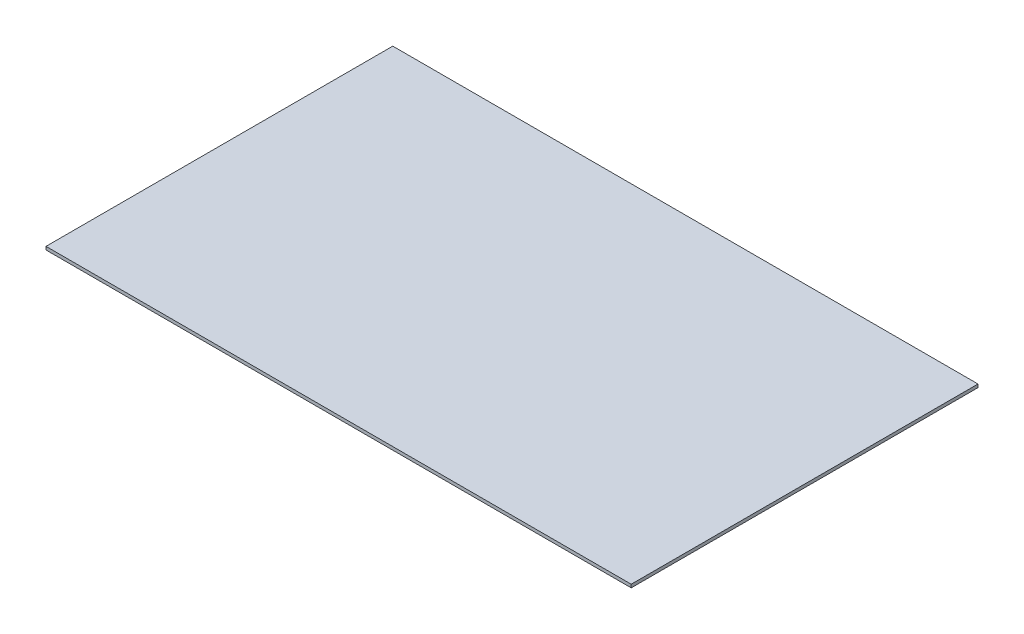
ISO-10303-21;
HEADER;
FILE_DESCRIPTION(('STEP AP214'),'2;1');
FILE_NAME('part.step','',(''),(''),'','','');
FILE_SCHEMA(('AUTOMOTIVE_DESIGN { 1 0 10303 214 1 1 1 1 }'));
ENDSEC;
DATA;
#1=APPLICATION_CONTEXT('core data for automotive mechanical design processes');
#2=APPLICATION_PROTOCOL_DEFINITION('international standard','automotive_design',2000,#1);
#3=PRODUCT_CONTEXT('',#1,'mechanical');
#4=PRODUCT('Part','Part','',(#3));
#5=PRODUCT_RELATED_PRODUCT_CATEGORY('part','',(#4));
#6=PRODUCT_DEFINITION_FORMATION('','',#4);
#7=PRODUCT_DEFINITION_CONTEXT('part definition',#1,'design');
#8=PRODUCT_DEFINITION('design','',#6,#7);
#9=PRODUCT_DEFINITION_SHAPE('','',#8);
#10=(LENGTH_UNIT() NAMED_UNIT(*) SI_UNIT(.MILLI.,.METRE.));
#11=(NAMED_UNIT(*) PLANE_ANGLE_UNIT() SI_UNIT($,.RADIAN.));
#12=(NAMED_UNIT(*) SI_UNIT($,.STERADIAN.) SOLID_ANGLE_UNIT());
#13=UNCERTAINTY_MEASURE_WITH_UNIT(LENGTH_MEASURE(1.E-05),#10,'distance_accuracy_value','');
#14=(GEOMETRIC_REPRESENTATION_CONTEXT(3) GLOBAL_UNCERTAINTY_ASSIGNED_CONTEXT((#13)) GLOBAL_UNIT_ASSIGNED_CONTEXT((#10,
#11,#12)) REPRESENTATION_CONTEXT('',''));
#15=CARTESIAN_POINT('',(0.,0.,0.));
#16=DIRECTION('',(0.,0.,1.));
#17=DIRECTION('',(1.,0.,0.));
#18=AXIS2_PLACEMENT_3D('',#15,#16,#17);
#19=CARTESIAN_POINT('',(0.,2.794,0.));
#20=DIRECTION('',(1.,0.,0.));
#21=DIRECTION('',(0.,0.,-1.));
#22=AXIS2_PLACEMENT_3D('',#19,#20,#21);
#23=PLANE('',#22);
#24=DIRECTION('',(0.,0.,1.));
#25=VECTOR('',#24,1.);
#26=CARTESIAN_POINT('',(0.,0.,0.));
#27=LINE('',#26,#25);
#28=CARTESIAN_POINT('',(0.,0.,-304.8));
#29=VERTEX_POINT('',#28);
#30=CARTESIAN_POINT('',(0.,0.,0.));
#31=VERTEX_POINT('',#30);
#32=EDGE_CURVE('E99',#29,#31,#27,.T.);
#33=ORIENTED_EDGE('',*,*,#32,.T.);
#34=DIRECTION('',(0.,-1.,0.));
#35=VECTOR('',#34,1.);
#36=CARTESIAN_POINT('',(0.,2.794,0.));
#37=LINE('',#36,#35);
#38=CARTESIAN_POINT('',(0.,2.794,0.));
#39=VERTEX_POINT('',#38);
#40=EDGE_CURVE('E11',#39,#31,#37,.T.);
#41=ORIENTED_EDGE('',*,*,#40,.F.);
#42=DIRECTION('',(0.,0.,1.));
#43=VECTOR('',#42,1.);
#44=CARTESIAN_POINT('',(0.,2.794,0.));
#45=LINE('',#44,#43);
#46=CARTESIAN_POINT('',(0.,2.794,-304.8));
#47=VERTEX_POINT('',#46);
#48=EDGE_CURVE('E87',#47,#39,#45,.T.);
#49=ORIENTED_EDGE('',*,*,#48,.F.);
#50=DIRECTION('',(0.,-1.,0.));
#51=VECTOR('',#50,1.);
#52=CARTESIAN_POINT('',(0.,2.794,-304.8));
#53=LINE('',#52,#51);
#54=EDGE_CURVE('E95',#47,#29,#53,.T.);
#55=ORIENTED_EDGE('',*,*,#54,.T.);
#56=EDGE_LOOP('',(#33,#41,#49,#55));
#57=FACE_BOUND('',#56,.T.);
#58=ADVANCED_FACE('F36',(#57),#23,.F.);
#59=CARTESIAN_POINT('',(0.,2.794,0.));
#60=DIRECTION('',(0.,0.,-1.));
#61=DIRECTION('',(-1.,0.,0.));
#62=AXIS2_PLACEMENT_3D('',#59,#60,#61);
#63=PLANE('',#62);
#64=DIRECTION('',(1.,0.,0.));
#65=VECTOR('',#64,1.);
#66=CARTESIAN_POINT('',(0.,0.,0.));
#67=LINE('',#66,#65);
#68=CARTESIAN_POINT('',(514.35,0.,0.));
#69=VERTEX_POINT('',#68);
#70=EDGE_CURVE('E91',#31,#69,#67,.T.);
#71=ORIENTED_EDGE('',*,*,#70,.T.);
#72=DIRECTION('',(0.,-1.,0.));
#73=VECTOR('',#72,1.);
#74=CARTESIAN_POINT('',(514.35,2.794,0.));
#75=LINE('',#74,#73);
#76=CARTESIAN_POINT('',(514.35,2.794,0.));
#77=VERTEX_POINT('',#76);
#78=EDGE_CURVE('E44',#77,#69,#75,.T.);
#79=ORIENTED_EDGE('',*,*,#78,.F.);
#80=DIRECTION('',(1.,0.,0.));
#81=VECTOR('',#80,1.);
#82=CARTESIAN_POINT('',(0.,2.794,0.));
#83=LINE('',#82,#81);
#84=EDGE_CURVE('E82',#39,#77,#83,.T.);
#85=ORIENTED_EDGE('',*,*,#84,.F.);
#86=ORIENTED_EDGE('',*,*,#40,.T.);
#87=EDGE_LOOP('',(#71,#79,#85,#86));
#88=FACE_BOUND('',#87,.T.);
#89=ADVANCED_FACE('F90',(#88),#63,.F.);
#90=CARTESIAN_POINT('',(514.35,2.794,0.));
#91=DIRECTION('',(-1.,0.,0.));
#92=DIRECTION('',(0.,0.,1.));
#93=AXIS2_PLACEMENT_3D('',#90,#91,#92);
#94=PLANE('',#93);
#95=DIRECTION('',(0.,0.,-1.));
#96=VECTOR('',#95,1.);
#97=CARTESIAN_POINT('',(514.35,0.,0.));
#98=LINE('',#97,#96);
#99=CARTESIAN_POINT('',(514.35,0.,-304.8));
#100=VERTEX_POINT('',#99);
#101=EDGE_CURVE('E69',#69,#100,#98,.T.);
#102=ORIENTED_EDGE('',*,*,#101,.T.);
#103=DIRECTION('',(0.,-1.,0.));
#104=VECTOR('',#103,1.);
#105=CARTESIAN_POINT('',(514.35,2.794,-304.8));
#106=LINE('',#105,#104);
#107=CARTESIAN_POINT('',(514.35,2.794,-304.8));
#108=VERTEX_POINT('',#107);
#109=EDGE_CURVE('E92',#108,#100,#106,.T.);
#110=ORIENTED_EDGE('',*,*,#109,.F.);
#111=DIRECTION('',(0.,0.,-1.));
#112=VECTOR('',#111,1.);
#113=CARTESIAN_POINT('',(514.35,2.794,0.));
#114=LINE('',#113,#112);
#115=EDGE_CURVE('E85',#77,#108,#114,.T.);
#116=ORIENTED_EDGE('',*,*,#115,.F.);
#117=ORIENTED_EDGE('',*,*,#78,.T.);
#118=EDGE_LOOP('',(#102,#110,#116,#117));
#119=FACE_BOUND('',#118,.T.);
#120=ADVANCED_FACE('F93',(#119),#94,.F.);
#121=CARTESIAN_POINT('',(0.,2.794,-304.8));
#122=DIRECTION('',(0.,0.,1.));
#123=DIRECTION('',(1.,0.,0.));
#124=AXIS2_PLACEMENT_3D('',#121,#122,#123);
#125=PLANE('',#124);
#126=DIRECTION('',(-1.,0.,0.));
#127=VECTOR('',#126,1.);
#128=CARTESIAN_POINT('',(0.,0.,-304.8));
#129=LINE('',#128,#127);
#130=EDGE_CURVE('E75',#100,#29,#129,.T.);
#131=ORIENTED_EDGE('',*,*,#130,.T.);
#132=ORIENTED_EDGE('',*,*,#54,.F.);
#133=DIRECTION('',(-1.,0.,0.));
#134=VECTOR('',#133,1.);
#135=CARTESIAN_POINT('',(0.,2.794,-304.8));
#136=LINE('',#135,#134);
#137=EDGE_CURVE('E52',#108,#47,#136,.T.);
#138=ORIENTED_EDGE('',*,*,#137,.F.);
#139=ORIENTED_EDGE('',*,*,#109,.T.);
#140=EDGE_LOOP('',(#131,#132,#138,#139));
#141=FACE_BOUND('',#140,.T.);
#142=ADVANCED_FACE('F106',(#141),#125,.F.);
#143=CARTESIAN_POINT('',(0.,2.794,0.));
#144=DIRECTION('',(0.,-1.,0.));
#145=DIRECTION('',(0.,0.,-1.));
#146=AXIS2_PLACEMENT_3D('',#143,#144,#145);
#147=PLANE('',#146);
#148=ORIENTED_EDGE('',*,*,#48,.T.);
#149=ORIENTED_EDGE('',*,*,#84,.T.);
#150=ORIENTED_EDGE('',*,*,#115,.T.);
#151=ORIENTED_EDGE('',*,*,#137,.T.);
#152=EDGE_LOOP('',(#148,#149,#150,#151));
#153=FACE_BOUND('',#152,.T.);
#154=ADVANCED_FACE('F83',(#153),#147,.F.);
#155=CARTESIAN_POINT('',(0.,0.,0.));
#156=DIRECTION('',(0.,-1.,0.));
#157=DIRECTION('',(0.,0.,-1.));
#158=AXIS2_PLACEMENT_3D('',#155,#156,#157);
#159=PLANE('',#158);
#160=ORIENTED_EDGE('',*,*,#32,.F.);
#161=ORIENTED_EDGE('',*,*,#130,.F.);
#162=ORIENTED_EDGE('',*,*,#101,.F.);
#163=ORIENTED_EDGE('',*,*,#70,.F.);
#164=EDGE_LOOP('',(#160,#161,#162,#163));
#165=FACE_BOUND('',#164,.T.);
#166=ADVANCED_FACE('F109',(#165),#159,.T.);
#167=CLOSED_SHELL('',(#58,#89,#120,#142,#154,#166));
#168=MANIFOLD_SOLID_BREP('B2',#167);
#169=ADVANCED_BREP_SHAPE_REPRESENTATION('',(#18,#168),#14);
#170=SHAPE_DEFINITION_REPRESENTATION(#9,#169);
ENDSEC;
END-ISO-10303-21;
